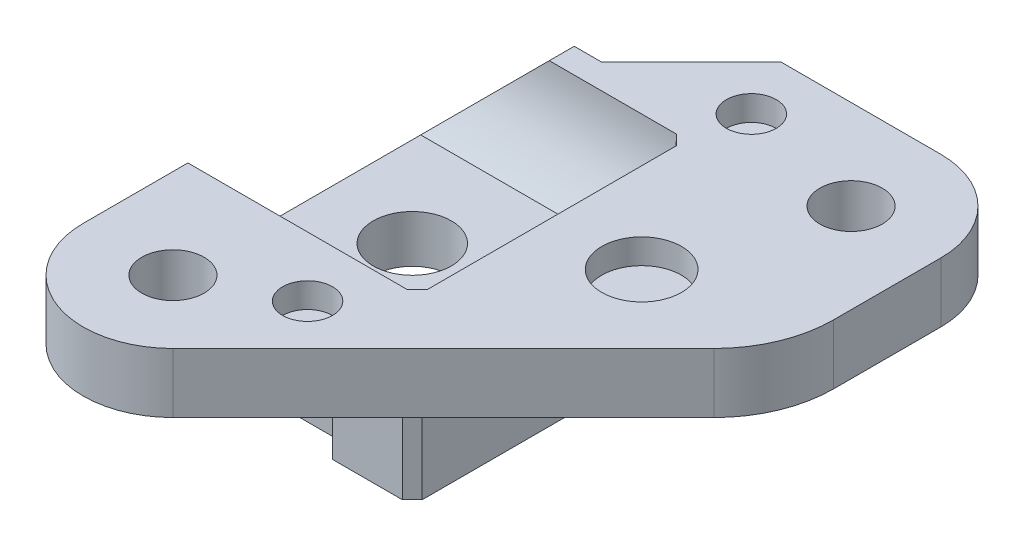
ISO-10303-21;
HEADER;
FILE_DESCRIPTION(('STEP AP214'),'2;1');
FILE_NAME('part.step','',(''),(''),'','','');
FILE_SCHEMA(('AUTOMOTIVE_DESIGN { 1 0 10303 214 1 1 1 1 }'));
ENDSEC;
DATA;
#1=APPLICATION_CONTEXT('core data for automotive mechanical design processes');
#2=APPLICATION_PROTOCOL_DEFINITION('international standard','automotive_design',2000,#1);
#3=PRODUCT_CONTEXT('',#1,'mechanical');
#4=PRODUCT('Part','Part','',(#3));
#5=PRODUCT_RELATED_PRODUCT_CATEGORY('part','',(#4));
#6=PRODUCT_DEFINITION_FORMATION('','',#4);
#7=PRODUCT_DEFINITION_CONTEXT('part definition',#1,'design');
#8=PRODUCT_DEFINITION('design','',#6,#7);
#9=PRODUCT_DEFINITION_SHAPE('','',#8);
#10=(LENGTH_UNIT() NAMED_UNIT(*) SI_UNIT(.MILLI.,.METRE.));
#11=(NAMED_UNIT(*) PLANE_ANGLE_UNIT() SI_UNIT($,.RADIAN.));
#12=(NAMED_UNIT(*) SI_UNIT($,.STERADIAN.) SOLID_ANGLE_UNIT());
#13=UNCERTAINTY_MEASURE_WITH_UNIT(LENGTH_MEASURE(1.E-05),#10,'distance_accuracy_value','');
#14=(GEOMETRIC_REPRESENTATION_CONTEXT(3) GLOBAL_UNCERTAINTY_ASSIGNED_CONTEXT((#13)) GLOBAL_UNIT_ASSIGNED_CONTEXT((#10,
#11,#12)) REPRESENTATION_CONTEXT('',''));
#15=CARTESIAN_POINT('',(0.,0.,0.));
#16=DIRECTION('',(0.,0.,1.));
#17=DIRECTION('',(1.,0.,0.));
#18=AXIS2_PLACEMENT_3D('',#15,#16,#17);
#19=CARTESIAN_POINT('',(14.,3.,-8.));
#20=DIRECTION('',(0.,1.,0.));
#21=DIRECTION('',(0.,0.,1.));
#22=AXIS2_PLACEMENT_3D('',#19,#20,#21);
#23=PLANE('',#22);
#24=CARTESIAN_POINT('',(7.5,3.,-9.5));
#25=DIRECTION('',(0.,1.,0.));
#26=DIRECTION('',(0.,0.,1.));
#27=AXIS2_PLACEMENT_3D('',#24,#25,#26);
#28=CIRCLE('',#27,1.25);
#29=CARTESIAN_POINT('',(7.5,3.,-8.25));
#30=VERTEX_POINT('',#29);
#31=EDGE_CURVE('E515',#30,#30,#28,.T.);
#32=ORIENTED_EDGE('',*,*,#31,.F.);
#33=EDGE_LOOP('',(#32));
#34=FACE_BOUND('',#33,.T.);
#35=CARTESIAN_POINT('',(4.5,3.,9.75));
#36=DIRECTION('',(0.,1.,0.));
#37=DIRECTION('',(0.,0.,1.));
#38=AXIS2_PLACEMENT_3D('',#35,#36,#37);
#39=CIRCLE('',#38,1.25);
#40=CARTESIAN_POINT('',(4.5,3.,11.));
#41=VERTEX_POINT('',#40);
#42=EDGE_CURVE('E509',#41,#41,#39,.T.);
#43=ORIENTED_EDGE('',*,*,#42,.F.);
#44=EDGE_LOOP('',(#43));
#45=FACE_BOUND('',#44,.T.);
#46=CARTESIAN_POINT('',(11.5,3.,0.));
#47=DIRECTION('',(0.,1.,0.));
#48=DIRECTION('',(0.,0.,1.));
#49=AXIS2_PLACEMENT_3D('',#46,#47,#48);
#50=CIRCLE('',#49,2.);
#51=CARTESIAN_POINT('',(11.5,3.,2.));
#52=VERTEX_POINT('',#51);
#53=EDGE_CURVE('E503',#52,#52,#50,.T.);
#54=ORIENTED_EDGE('',*,*,#53,.F.);
#55=EDGE_LOOP('',(#54));
#56=FACE_BOUND('',#55,.T.);
#57=DIRECTION('',(0.707106781186551,0.,-0.707106781186544));
#58=VECTOR('',#57,1.);
#59=CARTESIAN_POINT('',(3.18198051533945,3.,15.1819805153395));
#60=LINE('',#59,#58);
#61=CARTESIAN_POINT('',(3.18198051533945,3.,15.1819805153395));
#62=VERTEX_POINT('',#61);
#63=CARTESIAN_POINT('',(16.7426406871193,3.,1.62132034355981));
#64=VERTEX_POINT('',#63);
#65=EDGE_CURVE('E261',#62,#64,#60,.T.);
#66=ORIENTED_EDGE('',*,*,#65,.T.);
#67=CARTESIAN_POINT('',(12.5,3.,-2.6213203435595));
#68=DIRECTION('',(0.,1.,0.));
#69=DIRECTION('',(0.,0.,1.));
#70=AXIS2_PLACEMENT_3D('',#67,#68,#69);
#71=CIRCLE('',#70,6.);
#72=CARTESIAN_POINT('',(18.5,3.,-2.62132034355949));
#73=VERTEX_POINT('',#72);
#74=EDGE_CURVE('E11',#64,#73,#71,.T.);
#75=ORIENTED_EDGE('',*,*,#74,.T.);
#76=DIRECTION('',(0.,0.,-1.));
#77=VECTOR('',#76,1.);
#78=CARTESIAN_POINT('',(18.5,3.,-0.136038969320913));
#79=LINE('',#78,#77);
#80=CARTESIAN_POINT('',(18.5,3.,-8.));
#81=VERTEX_POINT('',#80);
#82=EDGE_CURVE('E263',#73,#81,#79,.T.);
#83=ORIENTED_EDGE('',*,*,#82,.T.);
#84=CARTESIAN_POINT('',(14.,3.,-8.));
#85=DIRECTION('',(0.,1.,0.));
#86=DIRECTION('',(0.,0.,1.));
#87=AXIS2_PLACEMENT_3D('',#84,#85,#86);
#88=CIRCLE('',#87,4.5);
#89=CARTESIAN_POINT('',(14.,3.,-12.5));
#90=VERTEX_POINT('',#89);
#91=EDGE_CURVE('E265',#81,#90,#88,.T.);
#92=ORIENTED_EDGE('',*,*,#91,.T.);
#93=DIRECTION('',(-1.,0.,0.));
#94=VECTOR('',#93,1.);
#95=CARTESIAN_POINT('',(5.99999999999999,3.,-12.5));
#96=LINE('',#95,#94);
#97=CARTESIAN_POINT('',(5.99999999999999,3.,-12.5));
#98=VERTEX_POINT('',#97);
#99=EDGE_CURVE('E267',#90,#98,#96,.T.);
#100=ORIENTED_EDGE('',*,*,#99,.T.);
#101=DIRECTION('',(-0.707106781186546,0.,0.707106781186549));
#102=VECTOR('',#101,1.);
#103=CARTESIAN_POINT('',(-4.5,3.,-1.99999999999998));
#104=LINE('',#103,#102);
#105=CARTESIAN_POINT('',(1.5,3.,-8.));
#106=VERTEX_POINT('',#105);
#107=EDGE_CURVE('E218',#98,#106,#104,.T.);
#108=ORIENTED_EDGE('',*,*,#107,.T.);
#109=DIRECTION('',(1.,0.,0.));
#110=VECTOR('',#109,1.);
#111=CARTESIAN_POINT('',(5.,3.,-8.));
#112=LINE('',#111,#110);
#113=CARTESIAN_POINT('',(0.120000000000051,3.,-8.));
#114=VERTEX_POINT('',#113);
#115=EDGE_CURVE('E209',#114,#106,#112,.T.);
#116=ORIENTED_EDGE('',*,*,#115,.F.);
#117=DIRECTION('',(0.,0.,-1.));
#118=VECTOR('',#117,1.);
#119=CARTESIAN_POINT('',(0.12000000000005,3.,-3.2375));
#120=LINE('',#119,#118);
#121=CARTESIAN_POINT('',(0.120000000000051,3.,-6.75));
#122=VERTEX_POINT('',#121);
#123=EDGE_CURVE('E193',#122,#114,#120,.T.);
#124=ORIENTED_EDGE('',*,*,#123,.F.);
#125=DIRECTION('',(-1.,0.,0.));
#126=VECTOR('',#125,1.);
#127=CARTESIAN_POINT('',(7.,3.,-6.75));
#128=LINE('',#127,#126);
#129=CARTESIAN_POINT('',(6.5,3.,-6.75));
#130=VERTEX_POINT('',#129);
#131=EDGE_CURVE('E318',#130,#122,#128,.T.);
#132=ORIENTED_EDGE('',*,*,#131,.F.);
#133=DIRECTION('',(-0.707106781186544,0.,-0.707106781186551));
#134=VECTOR('',#133,1.);
#135=CARTESIAN_POINT('',(13.2499999999999,3.,0.));
#136=LINE('',#135,#134);
#137=CARTESIAN_POINT('',(7.,3.,-6.24999999999999));
#138=VERTEX_POINT('',#137);
#139=EDGE_CURVE('E347',#130,#138,#136,.F.);
#140=ORIENTED_EDGE('',*,*,#139,.T.);
#141=DIRECTION('',(0.,0.,-1.));
#142=VECTOR('',#141,1.);
#143=CARTESIAN_POINT('',(7.,3.,-6.75));
#144=LINE('',#143,#142);
#145=CARTESIAN_POINT('',(7.,3.,6.24999999999999));
#146=VERTEX_POINT('',#145);
#147=EDGE_CURVE('E489',#146,#138,#144,.T.);
#148=ORIENTED_EDGE('',*,*,#147,.F.);
#149=DIRECTION('',(0.707106781186544,0.,-0.707106781186551));
#150=VECTOR('',#149,1.);
#151=CARTESIAN_POINT('',(13.2499999999999,3.,0.));
#152=LINE('',#151,#150);
#153=CARTESIAN_POINT('',(6.5,3.,6.75));
#154=VERTEX_POINT('',#153);
#155=EDGE_CURVE('E349',#146,#154,#152,.F.);
#156=ORIENTED_EDGE('',*,*,#155,.T.);
#157=DIRECTION('',(-1.,0.,0.));
#158=VECTOR('',#157,1.);
#159=CARTESIAN_POINT('',(7.,3.,6.75));
#160=LINE('',#159,#158);
#161=CARTESIAN_POINT('',(-4.5,3.,6.75));
#162=VERTEX_POINT('',#161);
#163=EDGE_CURVE('E492',#154,#162,#160,.T.);
#164=ORIENTED_EDGE('',*,*,#163,.T.);
#165=DIRECTION('',(0.,0.,1.));
#166=VECTOR('',#165,1.);
#167=CARTESIAN_POINT('',(-4.5,3.,6.5));
#168=LINE('',#167,#166);
#169=CARTESIAN_POINT('',(-4.5,3.,12.));
#170=VERTEX_POINT('',#169);
#171=EDGE_CURVE('E256',#162,#170,#168,.T.);
#172=ORIENTED_EDGE('',*,*,#171,.T.);
#173=CARTESIAN_POINT('',(0.,3.,12.));
#174=DIRECTION('',(0.,1.,0.));
#175=DIRECTION('',(0.,0.,-1.));
#176=AXIS2_PLACEMENT_3D('',#173,#174,#175);
#177=CIRCLE('',#176,4.5);
#178=EDGE_CURVE('E259',#170,#62,#177,.T.);
#179=ORIENTED_EDGE('',*,*,#178,.T.);
#180=EDGE_LOOP('',(#66,#75,#83,#92,#100,#108,#116,#124,#132,#140,#148,#156,#164,#172,#179));
#181=FACE_BOUND('',#180,.T.);
#182=CARTESIAN_POINT('',(0.,3.,12.));
#183=DIRECTION('',(0.,1.,0.));
#184=DIRECTION('',(0.,0.,1.));
#185=AXIS2_PLACEMENT_3D('',#182,#183,#184);
#186=CIRCLE('',#185,1.5625);
#187=CARTESIAN_POINT('',(0.,3.,13.5625));
#188=VERTEX_POINT('',#187);
#189=EDGE_CURVE('E249',#188,#188,#186,.T.);
#190=ORIENTED_EDGE('',*,*,#189,.F.);
#191=EDGE_LOOP('',(#190));
#192=FACE_BOUND('',#191,.T.);
#193=CARTESIAN_POINT('',(14.,3.,-8.));
#194=DIRECTION('',(0.,1.,0.));
#195=DIRECTION('',(0.,0.,1.));
#196=AXIS2_PLACEMENT_3D('',#193,#194,#195);
#197=CIRCLE('',#196,1.5625);
#198=CARTESIAN_POINT('',(14.,3.,-6.4375));
#199=VERTEX_POINT('',#198);
#200=EDGE_CURVE('E243',#199,#199,#197,.T.);
#201=ORIENTED_EDGE('',*,*,#200,.F.);
#202=EDGE_LOOP('',(#201));
#203=FACE_BOUND('',#202,.T.);
#204=ADVANCED_FACE('F30',(#34,#45,#56,#181,#192,#203),#23,.T.);
#205=CARTESIAN_POINT('',(14.,0.,-8.));
#206=DIRECTION('',(0.,1.,0.));
#207=DIRECTION('',(0.,0.,1.));
#208=AXIS2_PLACEMENT_3D('',#205,#206,#207);
#209=PLANE('',#208);
#210=CARTESIAN_POINT('',(0.,0.,12.));
#211=DIRECTION('',(0.,1.,0.));
#212=DIRECTION('',(0.,0.,1.));
#213=AXIS2_PLACEMENT_3D('',#210,#211,#212);
#214=CIRCLE('',#213,1.5625);
#215=CARTESIAN_POINT('',(0.,0.,13.5625));
#216=VERTEX_POINT('',#215);
#217=EDGE_CURVE('E246',#216,#216,#214,.T.);
#218=ORIENTED_EDGE('',*,*,#217,.T.);
#219=EDGE_LOOP('',(#218));
#220=FACE_BOUND('',#219,.T.);
#221=DIRECTION('',(0.,0.,-1.));
#222=VECTOR('',#221,1.);
#223=CARTESIAN_POINT('',(18.5,0.,-0.136038969320913));
#224=LINE('',#223,#222);
#225=CARTESIAN_POINT('',(18.5,0.,-2.62132034355949));
#226=VERTEX_POINT('',#225);
#227=CARTESIAN_POINT('',(18.5,0.,-8.));
#228=VERTEX_POINT('',#227);
#229=EDGE_CURVE('E275',#226,#228,#224,.T.);
#230=ORIENTED_EDGE('',*,*,#229,.F.);
#231=CARTESIAN_POINT('',(12.5,0.,-2.6213203435595));
#232=DIRECTION('',(0.,1.,0.));
#233=DIRECTION('',(0.,0.,1.));
#234=AXIS2_PLACEMENT_3D('',#231,#232,#233);
#235=CIRCLE('',#234,6.);
#236=CARTESIAN_POINT('',(16.7426406871193,0.,1.62132034355981));
#237=VERTEX_POINT('',#236);
#238=EDGE_CURVE('E52',#226,#237,#235,.F.);
#239=ORIENTED_EDGE('',*,*,#238,.T.);
#240=DIRECTION('',(0.707106781186551,0.,-0.707106781186544));
#241=VECTOR('',#240,1.);
#242=CARTESIAN_POINT('',(3.18198051533945,0.,15.1819805153395));
#243=LINE('',#242,#241);
#244=CARTESIAN_POINT('',(3.18198051533945,0.,15.1819805153395));
#245=VERTEX_POINT('',#244);
#246=EDGE_CURVE('E273',#245,#237,#243,.T.);
#247=ORIENTED_EDGE('',*,*,#246,.F.);
#248=CARTESIAN_POINT('',(0.,0.,12.));
#249=DIRECTION('',(0.,1.,0.));
#250=DIRECTION('',(0.,0.,-1.));
#251=AXIS2_PLACEMENT_3D('',#248,#249,#250);
#252=CIRCLE('',#251,4.5);
#253=CARTESIAN_POINT('',(-4.5,0.,12.));
#254=VERTEX_POINT('',#253);
#255=EDGE_CURVE('E271',#254,#245,#252,.T.);
#256=ORIENTED_EDGE('',*,*,#255,.F.);
#257=DIRECTION('',(0.,0.,1.));
#258=VECTOR('',#257,1.);
#259=CARTESIAN_POINT('',(-4.5,0.,12.));
#260=LINE('',#259,#258);
#261=CARTESIAN_POINT('',(-4.5,0.,8.));
#262=VERTEX_POINT('',#261);
#263=EDGE_CURVE('E252',#262,#254,#260,.T.);
#264=ORIENTED_EDGE('',*,*,#263,.F.);
#265=DIRECTION('',(1.,0.,0.));
#266=VECTOR('',#265,1.);
#267=CARTESIAN_POINT('',(14.,0.,8.));
#268=LINE('',#267,#266);
#269=CARTESIAN_POINT('',(5.,0.,8.));
#270=VERTEX_POINT('',#269);
#271=EDGE_CURVE('E239',#262,#270,#268,.T.);
#272=ORIENTED_EDGE('',*,*,#271,.T.);
#273=DIRECTION('',(0.,0.,1.));
#274=VECTOR('',#273,1.);
#275=CARTESIAN_POINT('',(5.,0.,-8.));
#276=LINE('',#275,#274);
#277=CARTESIAN_POINT('',(5.,0.,9.));
#278=VERTEX_POINT('',#277);
#279=EDGE_CURVE('E302',#270,#278,#276,.T.);
#280=ORIENTED_EDGE('',*,*,#279,.T.);
#281=DIRECTION('',(1.,0.,0.));
#282=VECTOR('',#281,1.);
#283=CARTESIAN_POINT('',(14.,0.,9.));
#284=LINE('',#283,#282);
#285=CARTESIAN_POINT('',(8.49999999999999,0.,9.));
#286=VERTEX_POINT('',#285);
#287=EDGE_CURVE('E299',#278,#286,#284,.T.);
#288=ORIENTED_EDGE('',*,*,#287,.T.);
#289=DIRECTION('',(-0.70710678118655,0.,0.707106781186545));
#290=VECTOR('',#289,1.);
#291=CARTESIAN_POINT('',(19.75,0.,-2.24999999999994));
#292=LINE('',#291,#290);
#293=CARTESIAN_POINT('',(9.,0.,8.5));
#294=VERTEX_POINT('',#293);
#295=EDGE_CURVE('E345',#286,#294,#292,.F.);
#296=ORIENTED_EDGE('',*,*,#295,.T.);
#297=DIRECTION('',(0.,0.,-1.));
#298=VECTOR('',#297,1.);
#299=CARTESIAN_POINT('',(9.,0.,-8.));
#300=LINE('',#299,#298);
#301=CARTESIAN_POINT('',(9.,0.,-8.5));
#302=VERTEX_POINT('',#301);
#303=EDGE_CURVE('E305',#294,#302,#300,.T.);
#304=ORIENTED_EDGE('',*,*,#303,.T.);
#305=DIRECTION('',(0.707106781186545,0.,0.70710678118655));
#306=VECTOR('',#305,1.);
#307=CARTESIAN_POINT('',(11.75,0.,-5.75));
#308=LINE('',#307,#306);
#309=CARTESIAN_POINT('',(8.5,0.,-9.));
#310=VERTEX_POINT('',#309);
#311=EDGE_CURVE('E351',#302,#310,#308,.F.);
#312=ORIENTED_EDGE('',*,*,#311,.T.);
#313=DIRECTION('',(-1.,0.,0.));
#314=VECTOR('',#313,1.);
#315=CARTESIAN_POINT('',(14.,0.,-9.));
#316=LINE('',#315,#314);
#317=CARTESIAN_POINT('',(5.,0.,-9.));
#318=VERTEX_POINT('',#317);
#319=EDGE_CURVE('E308',#310,#318,#316,.T.);
#320=ORIENTED_EDGE('',*,*,#319,.T.);
#321=DIRECTION('',(0.,0.,1.));
#322=VECTOR('',#321,1.);
#323=CARTESIAN_POINT('',(5.,0.,-8.));
#324=LINE('',#323,#322);
#325=CARTESIAN_POINT('',(5.,0.,-8.));
#326=VERTEX_POINT('',#325);
#327=EDGE_CURVE('E310',#318,#326,#324,.T.);
#328=ORIENTED_EDGE('',*,*,#327,.T.);
#329=DIRECTION('',(-1.,0.,0.));
#330=VECTOR('',#329,1.);
#331=CARTESIAN_POINT('',(14.,0.,-8.));
#332=LINE('',#331,#330);
#333=CARTESIAN_POINT('',(1.5,0.,-8.));
#334=VERTEX_POINT('',#333);
#335=EDGE_CURVE('E236',#326,#334,#332,.T.);
#336=ORIENTED_EDGE('',*,*,#335,.T.);
#337=DIRECTION('',(-0.707106781186546,0.,0.707106781186549));
#338=VECTOR('',#337,1.);
#339=CARTESIAN_POINT('',(1.,0.,-7.5));
#340=LINE('',#339,#338);
#341=CARTESIAN_POINT('',(5.99999999999999,0.,-12.5));
#342=VERTEX_POINT('',#341);
#343=EDGE_CURVE('E257',#342,#334,#340,.T.);
#344=ORIENTED_EDGE('',*,*,#343,.F.);
#345=DIRECTION('',(-1.,0.,0.));
#346=VECTOR('',#345,1.);
#347=CARTESIAN_POINT('',(5.99999999999999,0.,-12.5));
#348=LINE('',#347,#346);
#349=CARTESIAN_POINT('',(14.,0.,-12.5));
#350=VERTEX_POINT('',#349);
#351=EDGE_CURVE('E279',#350,#342,#348,.T.);
#352=ORIENTED_EDGE('',*,*,#351,.F.);
#353=CARTESIAN_POINT('',(14.,0.,-8.));
#354=DIRECTION('',(0.,1.,0.));
#355=DIRECTION('',(0.,0.,1.));
#356=AXIS2_PLACEMENT_3D('',#353,#354,#355);
#357=CIRCLE('',#356,4.5);
#358=EDGE_CURVE('E277',#228,#350,#357,.T.);
#359=ORIENTED_EDGE('',*,*,#358,.F.);
#360=EDGE_LOOP('',(#230,#239,#247,#256,#264,#272,#280,#288,#296,#304,#312,#320,#328,#336,#344,
#352,#359));
#361=FACE_BOUND('',#360,.T.);
#362=CARTESIAN_POINT('',(14.,0.,-8.));
#363=DIRECTION('',(0.,1.,0.));
#364=DIRECTION('',(0.,0.,1.));
#365=AXIS2_PLACEMENT_3D('',#362,#363,#364);
#366=CIRCLE('',#365,1.5625);
#367=CARTESIAN_POINT('',(14.,0.,-6.4375));
#368=VERTEX_POINT('',#367);
#369=EDGE_CURVE('E242',#368,#368,#366,.T.);
#370=ORIENTED_EDGE('',*,*,#369,.T.);
#371=EDGE_LOOP('',(#370));
#372=FACE_BOUND('',#371,.T.);
#373=ADVANCED_FACE('F390',(#220,#361,#372),#209,.F.);
#374=CARTESIAN_POINT('',(-4.5,3.,12.));
#375=DIRECTION('',(1.,0.,0.));
#376=DIRECTION('',(0.,0.,-1.));
#377=AXIS2_PLACEMENT_3D('',#374,#375,#376);
#378=PLANE('',#377);
#379=DIRECTION('',(0.,0.,1.));
#380=VECTOR('',#379,1.);
#381=CARTESIAN_POINT('',(-4.5,-1.62,-4.92118888074823));
#382=LINE('',#381,#380);
#383=CARTESIAN_POINT('',(-4.5,-1.62,-4.92118888074823));
#384=VERTEX_POINT('',#383);
#385=CARTESIAN_POINT('',(-4.5,-1.62,4.92118888074823));
#386=VERTEX_POINT('',#385);
#387=EDGE_CURVE('E498',#384,#386,#382,.T.);
#388=ORIENTED_EDGE('',*,*,#387,.F.);
#389=DIRECTION('',(0.,0.,-1.));
#390=VECTOR('',#389,1.);
#391=CARTESIAN_POINT('',(-4.5,-1.62,-3.2375));
#392=LINE('',#391,#390);
#393=CARTESIAN_POINT('',(-4.5,-1.62,-8.));
#394=VERTEX_POINT('',#393);
#395=EDGE_CURVE('E204',#384,#394,#392,.T.);
#396=ORIENTED_EDGE('',*,*,#395,.T.);
#397=DIRECTION('',(0.,-1.,0.));
#398=VECTOR('',#397,1.);
#399=CARTESIAN_POINT('',(-4.5,25.5,-8.));
#400=LINE('',#399,#398);
#401=CARTESIAN_POINT('',(-4.5,-4.,-8.));
#402=VERTEX_POINT('',#401);
#403=EDGE_CURVE('E212',#394,#402,#400,.T.);
#404=ORIENTED_EDGE('',*,*,#403,.T.);
#405=DIRECTION('',(0.,0.,-1.));
#406=VECTOR('',#405,1.);
#407=CARTESIAN_POINT('',(-4.5,-4.,-8.));
#408=LINE('',#407,#406);
#409=CARTESIAN_POINT('',(-4.5,-4.,8.));
#410=VERTEX_POINT('',#409);
#411=EDGE_CURVE('E470',#410,#402,#408,.T.);
#412=ORIENTED_EDGE('',*,*,#411,.F.);
#413=DIRECTION('',(0.,-1.,0.));
#414=VECTOR('',#413,1.);
#415=CARTESIAN_POINT('',(-4.5,25.5,8.));
#416=LINE('',#415,#414);
#417=EDGE_CURVE('E229',#262,#410,#416,.T.);
#418=ORIENTED_EDGE('',*,*,#417,.F.);
#419=ORIENTED_EDGE('',*,*,#263,.T.);
#420=DIRECTION('',(0.,-1.,0.));
#421=VECTOR('',#420,1.);
#422=CARTESIAN_POINT('',(-4.5,3.,12.));
#423=LINE('',#422,#421);
#424=EDGE_CURVE('E294',#170,#254,#423,.T.);
#425=ORIENTED_EDGE('',*,*,#424,.F.);
#426=ORIENTED_EDGE('',*,*,#171,.F.);
#427=CARTESIAN_POINT('',(-4.5,3.,0.));
#428=DIRECTION('',(-1.,0.,0.));
#429=DIRECTION('',(0.,0.,1.));
#430=AXIS2_PLACEMENT_3D('',#427,#428,#429);
#431=CIRCLE('',#430,6.75);
#432=EDGE_CURVE('E495',#386,#162,#431,.T.);
#433=ORIENTED_EDGE('',*,*,#432,.F.);
#434=EDGE_LOOP('',(#388,#396,#404,#412,#418,#419,#425,#426,#433));
#435=FACE_BOUND('',#434,.T.);
#436=ADVANCED_FACE('F396',(#435),#378,.F.);
#437=CARTESIAN_POINT('',(0.,3.,12.));
#438=DIRECTION('',(0.,-1.,0.));
#439=DIRECTION('',(0.,0.,-1.));
#440=AXIS2_PLACEMENT_3D('',#437,#438,#439);
#441=CYLINDRICAL_SURFACE('',#440,4.5);
#442=ORIENTED_EDGE('',*,*,#255,.T.);
#443=DIRECTION('',(0.,-1.,0.));
#444=VECTOR('',#443,1.);
#445=CARTESIAN_POINT('',(3.18198051533945,3.,15.1819805153395));
#446=LINE('',#445,#444);
#447=EDGE_CURVE('E291',#62,#245,#446,.T.);
#448=ORIENTED_EDGE('',*,*,#447,.F.);
#449=ORIENTED_EDGE('',*,*,#178,.F.);
#450=ORIENTED_EDGE('',*,*,#424,.T.);
#451=EDGE_LOOP('',(#442,#448,#449,#450));
#452=FACE_BOUND('',#451,.T.);
#453=ADVANCED_FACE('F424',(#452),#441,.T.);
#454=CARTESIAN_POINT('',(3.18198051533945,3.,15.1819805153395));
#455=DIRECTION('',(-0.707106781186544,0.,-0.707106781186551));
#456=DIRECTION('',(-0.707106781186551,0.,0.707106781186544));
#457=AXIS2_PLACEMENT_3D('',#454,#455,#456);
#458=PLANE('',#457);
#459=ORIENTED_EDGE('',*,*,#246,.T.);
#460=DIRECTION('',(0.,-1.,0.));
#461=VECTOR('',#460,1.);
#462=CARTESIAN_POINT('',(16.7426406871193,3.,1.62132034355981));
#463=LINE('',#462,#461);
#464=EDGE_CURVE('E38',#237,#64,#463,.F.);
#465=ORIENTED_EDGE('',*,*,#464,.T.);
#466=ORIENTED_EDGE('',*,*,#65,.F.);
#467=ORIENTED_EDGE('',*,*,#447,.T.);
#468=EDGE_LOOP('',(#459,#465,#466,#467));
#469=FACE_BOUND('',#468,.T.);
#470=ADVANCED_FACE('F420',(#469),#458,.F.);
#471=CARTESIAN_POINT('',(18.5,3.,-0.136038969320913));
#472=DIRECTION('',(-1.,0.,0.));
#473=DIRECTION('',(0.,0.,1.));
#474=AXIS2_PLACEMENT_3D('',#471,#472,#473);
#475=PLANE('',#474);
#476=ORIENTED_EDGE('',*,*,#82,.F.);
#477=DIRECTION('',(0.,-1.,0.));
#478=VECTOR('',#477,1.);
#479=CARTESIAN_POINT('',(18.5,3.,-2.6213203435595));
#480=LINE('',#479,#478);
#481=EDGE_CURVE('E823',#73,#226,#480,.T.);
#482=ORIENTED_EDGE('',*,*,#481,.T.);
#483=ORIENTED_EDGE('',*,*,#229,.T.);
#484=DIRECTION('',(0.,-1.,0.));
#485=VECTOR('',#484,1.);
#486=CARTESIAN_POINT('',(18.5,3.,-8.));
#487=LINE('',#486,#485);
#488=EDGE_CURVE('E288',#81,#228,#487,.T.);
#489=ORIENTED_EDGE('',*,*,#488,.F.);
#490=EDGE_LOOP('',(#476,#482,#483,#489));
#491=FACE_BOUND('',#490,.T.);
#492=ADVANCED_FACE('F416',(#491),#475,.F.);
#493=CARTESIAN_POINT('',(14.,3.,-8.));
#494=DIRECTION('',(0.,-1.,0.));
#495=DIRECTION('',(0.,0.,-1.));
#496=AXIS2_PLACEMENT_3D('',#493,#494,#495);
#497=CYLINDRICAL_SURFACE('',#496,4.5);
#498=ORIENTED_EDGE('',*,*,#358,.T.);
#499=DIRECTION('',(0.,-1.,0.));
#500=VECTOR('',#499,1.);
#501=CARTESIAN_POINT('',(14.,3.,-12.5));
#502=LINE('',#501,#500);
#503=EDGE_CURVE('E285',#90,#350,#502,.T.);
#504=ORIENTED_EDGE('',*,*,#503,.F.);
#505=ORIENTED_EDGE('',*,*,#91,.F.);
#506=ORIENTED_EDGE('',*,*,#488,.T.);
#507=EDGE_LOOP('',(#498,#504,#505,#506));
#508=FACE_BOUND('',#507,.T.);
#509=ADVANCED_FACE('F412',(#508),#497,.T.);
#510=CARTESIAN_POINT('',(5.99999999999999,3.,-12.5));
#511=DIRECTION('',(0.,0.,1.));
#512=DIRECTION('',(1.,0.,0.));
#513=AXIS2_PLACEMENT_3D('',#510,#511,#512);
#514=PLANE('',#513);
#515=ORIENTED_EDGE('',*,*,#351,.T.);
#516=DIRECTION('',(0.,-1.,0.));
#517=VECTOR('',#516,1.);
#518=CARTESIAN_POINT('',(5.99999999999999,3.,-12.5));
#519=LINE('',#518,#517);
#520=EDGE_CURVE('E269',#98,#342,#519,.T.);
#521=ORIENTED_EDGE('',*,*,#520,.F.);
#522=ORIENTED_EDGE('',*,*,#99,.F.);
#523=ORIENTED_EDGE('',*,*,#503,.T.);
#524=EDGE_LOOP('',(#515,#521,#522,#523));
#525=FACE_BOUND('',#524,.T.);
#526=ADVANCED_FACE('F408',(#525),#514,.F.);
#527=CARTESIAN_POINT('',(1.,3.,-7.5));
#528=DIRECTION('',(0.707106781186548,0.,0.707106781186546));
#529=DIRECTION('',(0.707106781186546,0.,-0.707106781186549));
#530=AXIS2_PLACEMENT_3D('',#527,#528,#529);
#531=PLANE('',#530);
#532=ORIENTED_EDGE('',*,*,#343,.T.);
#533=DIRECTION('',(0.,1.,0.));
#534=VECTOR('',#533,1.);
#535=CARTESIAN_POINT('',(1.5,3.,-8.));
#536=LINE('',#535,#534);
#537=EDGE_CURVE('E297',#334,#106,#536,.T.);
#538=ORIENTED_EDGE('',*,*,#537,.T.);
#539=ORIENTED_EDGE('',*,*,#107,.F.);
#540=ORIENTED_EDGE('',*,*,#520,.T.);
#541=EDGE_LOOP('',(#532,#538,#539,#540));
#542=FACE_BOUND('',#541,.T.);
#543=ADVANCED_FACE('F405',(#542),#531,.F.);
#544=CARTESIAN_POINT('',(0.,3.,12.));
#545=DIRECTION('',(0.,-1.,0.));
#546=DIRECTION('',(0.,0.,-1.));
#547=AXIS2_PLACEMENT_3D('',#544,#545,#546);
#548=CYLINDRICAL_SURFACE('',#547,1.5625);
#549=ORIENTED_EDGE('',*,*,#189,.T.);
#550=EDGE_LOOP('',(#549));
#551=FACE_BOUND('',#550,.T.);
#552=ORIENTED_EDGE('',*,*,#217,.F.);
#553=EDGE_LOOP('',(#552));
#554=FACE_BOUND('',#553,.T.);
#555=ADVANCED_FACE('F402',(#551,#554),#548,.F.);
#556=CARTESIAN_POINT('',(14.,3.,-8.));
#557=DIRECTION('',(0.,-1.,0.));
#558=DIRECTION('',(0.,0.,-1.));
#559=AXIS2_PLACEMENT_3D('',#556,#557,#558);
#560=CYLINDRICAL_SURFACE('',#559,1.5625);
#561=ORIENTED_EDGE('',*,*,#200,.T.);
#562=EDGE_LOOP('',(#561));
#563=FACE_BOUND('',#562,.T.);
#564=ORIENTED_EDGE('',*,*,#369,.F.);
#565=EDGE_LOOP('',(#564));
#566=FACE_BOUND('',#565,.T.);
#567=ADVANCED_FACE('F582',(#563,#566),#560,.F.);
#568=CARTESIAN_POINT('',(9.,25.5,-9.));
#569=DIRECTION('',(1.,0.,0.));
#570=DIRECTION('',(0.,0.,-1.));
#571=AXIS2_PLACEMENT_3D('',#568,#569,#570);
#572=PLANE('',#571);
#573=ORIENTED_EDGE('',*,*,#303,.F.);
#574=DIRECTION('',(0.,-1.,0.));
#575=VECTOR('',#574,1.);
#576=CARTESIAN_POINT('',(9.,25.5,8.5));
#577=LINE('',#576,#575);
#578=CARTESIAN_POINT('',(9.,-4.,8.49999999999999));
#579=VERTEX_POINT('',#578);
#580=EDGE_CURVE('E320',#294,#579,#577,.T.);
#581=ORIENTED_EDGE('',*,*,#580,.T.);
#582=DIRECTION('',(0.,0.,1.));
#583=VECTOR('',#582,1.);
#584=CARTESIAN_POINT('',(9.,-4.,-9.));
#585=LINE('',#584,#583);
#586=CARTESIAN_POINT('',(9.,-4.,-8.5));
#587=VERTEX_POINT('',#586);
#588=EDGE_CURVE('E449',#587,#579,#585,.T.);
#589=ORIENTED_EDGE('',*,*,#588,.F.);
#590=DIRECTION('',(0.,1.,0.));
#591=VECTOR('',#590,1.);
#592=CARTESIAN_POINT('',(9.,25.5,-8.5));
#593=LINE('',#592,#591);
#594=EDGE_CURVE('E313',#587,#302,#593,.T.);
#595=ORIENTED_EDGE('',*,*,#594,.T.);
#596=EDGE_LOOP('',(#573,#581,#589,#595));
#597=FACE_BOUND('',#596,.T.);
#598=ADVANCED_FACE('F445',(#597),#572,.T.);
#599=CARTESIAN_POINT('',(9.,25.5,-9.));
#600=DIRECTION('',(0.,0.,-1.));
#601=DIRECTION('',(-1.,0.,0.));
#602=AXIS2_PLACEMENT_3D('',#599,#600,#601);
#603=PLANE('',#602);
#604=ORIENTED_EDGE('',*,*,#319,.F.);
#605=DIRECTION('',(0.,-1.,0.));
#606=VECTOR('',#605,1.);
#607=CARTESIAN_POINT('',(8.5,25.5,-9.));
#608=LINE('',#607,#606);
#609=CARTESIAN_POINT('',(8.5,-4.,-9.));
#610=VERTEX_POINT('',#609);
#611=EDGE_CURVE('E342',#310,#610,#608,.T.);
#612=ORIENTED_EDGE('',*,*,#611,.T.);
#613=DIRECTION('',(1.,0.,0.));
#614=VECTOR('',#613,1.);
#615=CARTESIAN_POINT('',(9.,-4.,-9.));
#616=LINE('',#615,#614);
#617=CARTESIAN_POINT('',(5.,-4.,-9.));
#618=VERTEX_POINT('',#617);
#619=EDGE_CURVE('E223',#618,#610,#616,.T.);
#620=ORIENTED_EDGE('',*,*,#619,.F.);
#621=DIRECTION('',(0.,-1.,0.));
#622=VECTOR('',#621,1.);
#623=CARTESIAN_POINT('',(5.,25.5,-9.));
#624=LINE('',#623,#622);
#625=EDGE_CURVE('E220',#318,#618,#624,.T.);
#626=ORIENTED_EDGE('',*,*,#625,.F.);
#627=EDGE_LOOP('',(#604,#612,#620,#626));
#628=FACE_BOUND('',#627,.T.);
#629=ADVANCED_FACE('F455',(#628),#603,.T.);
#630=CARTESIAN_POINT('',(5.,25.5,-9.));
#631=DIRECTION('',(-1.,0.,0.));
#632=DIRECTION('',(0.,0.,1.));
#633=AXIS2_PLACEMENT_3D('',#630,#631,#632);
#634=PLANE('',#633);
#635=ORIENTED_EDGE('',*,*,#327,.F.);
#636=ORIENTED_EDGE('',*,*,#625,.T.);
#637=DIRECTION('',(0.,0.,-1.));
#638=VECTOR('',#637,1.);
#639=CARTESIAN_POINT('',(5.,-4.,-9.));
#640=LINE('',#639,#638);
#641=CARTESIAN_POINT('',(5.,-4.,-8.));
#642=VERTEX_POINT('',#641);
#643=EDGE_CURVE('E463',#642,#618,#640,.T.);
#644=ORIENTED_EDGE('',*,*,#643,.F.);
#645=DIRECTION('',(0.,-1.,0.));
#646=VECTOR('',#645,1.);
#647=CARTESIAN_POINT('',(5.,25.5,-8.));
#648=LINE('',#647,#646);
#649=EDGE_CURVE('E219',#326,#642,#648,.T.);
#650=ORIENTED_EDGE('',*,*,#649,.F.);
#651=EDGE_LOOP('',(#635,#636,#644,#650));
#652=FACE_BOUND('',#651,.T.);
#653=ADVANCED_FACE('F461',(#652),#634,.T.);
#654=CARTESIAN_POINT('',(5.,25.5,8.));
#655=DIRECTION('',(-1.,0.,0.));
#656=DIRECTION('',(0.,0.,1.));
#657=AXIS2_PLACEMENT_3D('',#654,#655,#656);
#658=PLANE('',#657);
#659=ORIENTED_EDGE('',*,*,#279,.F.);
#660=DIRECTION('',(0.,-1.,0.));
#661=VECTOR('',#660,1.);
#662=CARTESIAN_POINT('',(5.,25.5,8.));
#663=LINE('',#662,#661);
#664=CARTESIAN_POINT('',(5.,-4.,8.));
#665=VERTEX_POINT('',#664);
#666=EDGE_CURVE('E231',#270,#665,#663,.T.);
#667=ORIENTED_EDGE('',*,*,#666,.T.);
#668=DIRECTION('',(0.,0.,-1.));
#669=VECTOR('',#668,1.);
#670=CARTESIAN_POINT('',(5.,-4.,8.));
#671=LINE('',#670,#669);
#672=CARTESIAN_POINT('',(5.,-4.,9.));
#673=VERTEX_POINT('',#672);
#674=EDGE_CURVE('E477',#673,#665,#671,.T.);
#675=ORIENTED_EDGE('',*,*,#674,.F.);
#676=DIRECTION('',(0.,-1.,0.));
#677=VECTOR('',#676,1.);
#678=CARTESIAN_POINT('',(5.,25.5,9.));
#679=LINE('',#678,#677);
#680=EDGE_CURVE('E233',#278,#673,#679,.T.);
#681=ORIENTED_EDGE('',*,*,#680,.F.);
#682=EDGE_LOOP('',(#659,#667,#675,#681));
#683=FACE_BOUND('',#682,.T.);
#684=ADVANCED_FACE('F565',(#683),#658,.T.);
#685=CARTESIAN_POINT('',(9.,25.5,9.));
#686=DIRECTION('',(0.,0.,1.));
#687=DIRECTION('',(1.,0.,0.));
#688=AXIS2_PLACEMENT_3D('',#685,#686,#687);
#689=PLANE('',#688);
#690=DIRECTION('',(-1.,0.,0.));
#691=VECTOR('',#690,1.);
#692=CARTESIAN_POINT('',(9.,-4.,9.));
#693=LINE('',#692,#691);
#694=CARTESIAN_POINT('',(8.49999999999999,-4.,9.));
#695=VERTEX_POINT('',#694);
#696=EDGE_CURVE('E480',#695,#673,#693,.T.);
#697=ORIENTED_EDGE('',*,*,#696,.F.);
#698=DIRECTION('',(0.,1.,0.));
#699=VECTOR('',#698,1.);
#700=CARTESIAN_POINT('',(8.49999999999999,25.5,9.));
#701=LINE('',#700,#699);
#702=EDGE_CURVE('E327',#695,#286,#701,.T.);
#703=ORIENTED_EDGE('',*,*,#702,.T.);
#704=ORIENTED_EDGE('',*,*,#287,.F.);
#705=ORIENTED_EDGE('',*,*,#680,.T.);
#706=EDGE_LOOP('',(#697,#703,#704,#705));
#707=FACE_BOUND('',#706,.T.);
#708=ADVANCED_FACE('F561',(#707),#689,.T.);
#709=CARTESIAN_POINT('',(0.,25.5,0.));
#710=DIRECTION('',(0.,-1.,0.));
#711=DIRECTION('',(0.,0.,-1.));
#712=AXIS2_PLACEMENT_3D('',#709,#710,#711);
#713=CYLINDRICAL_SURFACE('',#712,1.96);
#714=CARTESIAN_POINT('',(0.,-1.62,0.));
#715=DIRECTION('',(0.,-1.,0.));
#716=DIRECTION('',(0.,0.,-1.));
#717=AXIS2_PLACEMENT_3D('',#714,#715,#716);
#718=CIRCLE('',#717,1.96);
#719=CARTESIAN_POINT('',(0.,-1.62,-1.96));
#720=VERTEX_POINT('',#719);
#721=EDGE_CURVE('E314',#720,#720,#718,.F.);
#722=ORIENTED_EDGE('',*,*,#721,.T.);
#723=EDGE_LOOP('',(#722));
#724=FACE_BOUND('',#723,.T.);
#725=CARTESIAN_POINT('',(0.,-4.,0.));
#726=DIRECTION('',(0.,-1.,0.));
#727=DIRECTION('',(0.,0.,-1.));
#728=AXIS2_PLACEMENT_3D('',#725,#726,#727);
#729=CIRCLE('',#728,1.96);
#730=CARTESIAN_POINT('',(0.,-4.,-1.96));
#731=VERTEX_POINT('',#730);
#732=EDGE_CURVE('E317',#731,#731,#729,.T.);
#733=ORIENTED_EDGE('',*,*,#732,.T.);
#734=EDGE_LOOP('',(#733));
#735=FACE_BOUND('',#734,.T.);
#736=ADVANCED_FACE('F564',(#724,#735),#713,.F.);
#737=CARTESIAN_POINT('',(5.,25.5,8.));
#738=DIRECTION('',(0.,0.,1.));
#739=DIRECTION('',(1.,0.,0.));
#740=AXIS2_PLACEMENT_3D('',#737,#738,#739);
#741=PLANE('',#740);
#742=ORIENTED_EDGE('',*,*,#271,.F.);
#743=ORIENTED_EDGE('',*,*,#417,.T.);
#744=DIRECTION('',(-1.,0.,0.));
#745=VECTOR('',#744,1.);
#746=CARTESIAN_POINT('',(5.,-4.,8.));
#747=LINE('',#746,#745);
#748=EDGE_CURVE('E474',#665,#410,#747,.T.);
#749=ORIENTED_EDGE('',*,*,#748,.F.);
#750=ORIENTED_EDGE('',*,*,#666,.F.);
#751=EDGE_LOOP('',(#742,#743,#749,#750));
#752=FACE_BOUND('',#751,.T.);
#753=ADVANCED_FACE('F570',(#752),#741,.T.);
#754=CARTESIAN_POINT('',(5.,25.5,-8.));
#755=DIRECTION('',(0.,0.,-1.));
#756=DIRECTION('',(-1.,0.,0.));
#757=AXIS2_PLACEMENT_3D('',#754,#755,#756);
#758=PLANE('',#757);
#759=DIRECTION('',(-0.707106781186551,-0.707106781186544,0.));
#760=VECTOR('',#759,1.);
#761=CARTESIAN_POINT('',(-4.5,-1.62,-8.));
#762=LINE('',#761,#760);
#763=EDGE_CURVE('E196',#114,#394,#762,.T.);
#764=ORIENTED_EDGE('',*,*,#763,.F.);
#765=ORIENTED_EDGE('',*,*,#115,.T.);
#766=ORIENTED_EDGE('',*,*,#537,.F.);
#767=ORIENTED_EDGE('',*,*,#335,.F.);
#768=ORIENTED_EDGE('',*,*,#649,.T.);
#769=DIRECTION('',(1.,0.,0.));
#770=VECTOR('',#769,1.);
#771=CARTESIAN_POINT('',(5.,-4.,-8.));
#772=LINE('',#771,#770);
#773=EDGE_CURVE('E469',#402,#642,#772,.T.);
#774=ORIENTED_EDGE('',*,*,#773,.F.);
#775=ORIENTED_EDGE('',*,*,#403,.F.);
#776=EDGE_LOOP('',(#764,#765,#766,#767,#768,#774,#775));
#777=FACE_BOUND('',#776,.T.);
#778=ADVANCED_FACE('F208',(#777),#758,.T.);
#779=CARTESIAN_POINT('',(9.,-4.,9.));
#780=DIRECTION('',(0.,-1.,0.));
#781=DIRECTION('',(0.,0.,-1.));
#782=AXIS2_PLACEMENT_3D('',#779,#780,#781);
#783=PLANE('',#782);
#784=ORIENTED_EDGE('',*,*,#588,.T.);
#785=DIRECTION('',(0.70710678118655,0.,-0.707106781186545));
#786=VECTOR('',#785,1.);
#787=CARTESIAN_POINT('',(8.75,-4.,8.75));
#788=LINE('',#787,#786);
#789=EDGE_CURVE('E325',#579,#695,#788,.F.);
#790=ORIENTED_EDGE('',*,*,#789,.T.);
#791=ORIENTED_EDGE('',*,*,#696,.T.);
#792=ORIENTED_EDGE('',*,*,#674,.T.);
#793=ORIENTED_EDGE('',*,*,#748,.T.);
#794=ORIENTED_EDGE('',*,*,#411,.T.);
#795=ORIENTED_EDGE('',*,*,#773,.T.);
#796=ORIENTED_EDGE('',*,*,#643,.T.);
#797=ORIENTED_EDGE('',*,*,#619,.T.);
#798=DIRECTION('',(-0.707106781186545,0.,-0.70710678118655));
#799=VECTOR('',#798,1.);
#800=CARTESIAN_POINT('',(17.75,-4.,0.250000000000063));
#801=LINE('',#800,#799);
#802=EDGE_CURVE('E323',#610,#587,#801,.F.);
#803=ORIENTED_EDGE('',*,*,#802,.T.);
#804=EDGE_LOOP('',(#784,#790,#791,#792,#793,#794,#795,#796,#797,#803));
#805=FACE_BOUND('',#804,.T.);
#806=ORIENTED_EDGE('',*,*,#732,.F.);
#807=EDGE_LOOP('',(#806));
#808=FACE_BOUND('',#807,.T.);
#809=ADVANCED_FACE('F466',(#805,#808),#783,.T.);
#810=CARTESIAN_POINT('',(7.,-1.62,-4.92118888074823));
#811=DIRECTION('',(0.,-1.,0.));
#812=DIRECTION('',(0.,0.,-1.));
#813=AXIS2_PLACEMENT_3D('',#810,#811,#812);
#814=PLANE('',#813);
#815=DIRECTION('',(-1.,0.,0.));
#816=VECTOR('',#815,1.);
#817=CARTESIAN_POINT('',(7.,-1.62,4.92118888074823));
#818=LINE('',#817,#816);
#819=CARTESIAN_POINT('',(6.5,-1.62,4.92118888074823));
#820=VERTEX_POINT('',#819);
#821=EDGE_CURVE('E488',#820,#386,#818,.T.);
#822=ORIENTED_EDGE('',*,*,#821,.F.);
#823=DIRECTION('',(0.,0.,-1.));
#824=VECTOR('',#823,1.);
#825=CARTESIAN_POINT('',(6.5,-1.62,-4.92118888074823));
#826=LINE('',#825,#824);
#827=CARTESIAN_POINT('',(6.5,-1.62,-4.92118888074823));
#828=VERTEX_POINT('',#827);
#829=EDGE_CURVE('E338',#820,#828,#826,.T.);
#830=ORIENTED_EDGE('',*,*,#829,.T.);
#831=DIRECTION('',(-1.,0.,0.));
#832=VECTOR('',#831,1.);
#833=CARTESIAN_POINT('',(7.,-1.62,-4.92118888074823));
#834=LINE('',#833,#832);
#835=EDGE_CURVE('E485',#828,#384,#834,.T.);
#836=ORIENTED_EDGE('',*,*,#835,.T.);
#837=ORIENTED_EDGE('',*,*,#387,.T.);
#838=EDGE_LOOP('',(#822,#830,#836,#837));
#839=FACE_BOUND('',#838,.T.);
#840=ORIENTED_EDGE('',*,*,#721,.F.);
#841=EDGE_LOOP('',(#840));
#842=FACE_BOUND('',#841,.T.);
#843=ADVANCED_FACE('F552',(#839,#842),#814,.F.);
#844=CARTESIAN_POINT('',(7.,3.,0.));
#845=DIRECTION('',(-1.,0.,0.));
#846=DIRECTION('',(0.,0.,1.));
#847=AXIS2_PLACEMENT_3D('',#844,#845,#846);
#848=CYLINDRICAL_SURFACE('',#847,6.75);
#849=ORIENTED_EDGE('',*,*,#131,.T.);
#850=CARTESIAN_POINT('',(0.12000000000005,3.,0.));
#851=DIRECTION('',(0.707106781186544,-0.707106781186551,0.));
#852=DIRECTION('',(-0.707106781186551,-0.707106781186544,0.));
#853=AXIS2_PLACEMENT_3D('',#850,#851,#852);
#854=ELLIPSE('',#853,9.54594154601844,6.75);
#855=EDGE_CURVE('E199',#122,#384,#854,.F.);
#856=ORIENTED_EDGE('',*,*,#855,.T.);
#857=ORIENTED_EDGE('',*,*,#835,.F.);
#858=CARTESIAN_POINT('',(6.5,3.,0.));
#859=DIRECTION('',(-1.,0.,0.));
#860=DIRECTION('',(0.,0.,1.));
#861=AXIS2_PLACEMENT_3D('',#858,#859,#860);
#862=CIRCLE('',#861,6.75);
#863=EDGE_CURVE('E336',#828,#130,#862,.F.);
#864=ORIENTED_EDGE('',*,*,#863,.T.);
#865=EDGE_LOOP('',(#849,#856,#857,#864));
#866=FACE_BOUND('',#865,.T.);
#867=ADVANCED_FACE('F550',(#866),#848,.F.);
#868=CARTESIAN_POINT('',(7.,3.,0.));
#869=DIRECTION('',(-1.,0.,0.));
#870=DIRECTION('',(0.,0.,1.));
#871=AXIS2_PLACEMENT_3D('',#868,#869,#870);
#872=CYLINDRICAL_SURFACE('',#871,6.75);
#873=ORIENTED_EDGE('',*,*,#163,.F.);
#874=CARTESIAN_POINT('',(6.5,3.,0.));
#875=DIRECTION('',(-1.,0.,0.));
#876=DIRECTION('',(0.,0.,1.));
#877=AXIS2_PLACEMENT_3D('',#874,#875,#876);
#878=CIRCLE('',#877,6.75);
#879=EDGE_CURVE('E340',#154,#820,#878,.F.);
#880=ORIENTED_EDGE('',*,*,#879,.T.);
#881=ORIENTED_EDGE('',*,*,#821,.T.);
#882=ORIENTED_EDGE('',*,*,#432,.T.);
#883=EDGE_LOOP('',(#873,#880,#881,#882));
#884=FACE_BOUND('',#883,.T.);
#885=ADVANCED_FACE('F436',(#884),#872,.F.);
#886=CARTESIAN_POINT('',(7.,3.,0.));
#887=DIRECTION('',(-1.,0.,0.));
#888=DIRECTION('',(0.,0.,1.));
#889=AXIS2_PLACEMENT_3D('',#886,#887,#888);
#890=PLANE('',#889);
#891=ORIENTED_EDGE('',*,*,#147,.T.);
#892=CARTESIAN_POINT('',(7.,3.,0.));
#893=DIRECTION('',(-1.,0.,0.));
#894=DIRECTION('',(0.,0.,1.));
#895=AXIS2_PLACEMENT_3D('',#892,#893,#894);
#896=CIRCLE('',#895,6.24999999999999);
#897=CARTESIAN_POINT('',(7.,-1.11999999999999,-4.69979786799392));
#898=VERTEX_POINT('',#897);
#899=EDGE_CURVE('E333',#138,#898,#896,.T.);
#900=ORIENTED_EDGE('',*,*,#899,.T.);
#901=DIRECTION('',(0.,0.,1.));
#902=VECTOR('',#901,1.);
#903=CARTESIAN_POINT('',(7.,-1.11999999999999,0.));
#904=LINE('',#903,#902);
#905=CARTESIAN_POINT('',(7.,-1.11999999999996,4.69979786799392));
#906=VERTEX_POINT('',#905);
#907=EDGE_CURVE('E331',#898,#906,#904,.T.);
#908=ORIENTED_EDGE('',*,*,#907,.T.);
#909=CARTESIAN_POINT('',(7.,3.,0.));
#910=DIRECTION('',(-1.,0.,0.));
#911=DIRECTION('',(0.,0.,1.));
#912=AXIS2_PLACEMENT_3D('',#909,#910,#911);
#913=CIRCLE('',#912,6.24999999999999);
#914=EDGE_CURVE('E329',#906,#146,#913,.T.);
#915=ORIENTED_EDGE('',*,*,#914,.T.);
#916=EDGE_LOOP('',(#891,#900,#908,#915));
#917=FACE_BOUND('',#916,.T.);
#918=ADVANCED_FACE('F431',(#917),#890,.T.);
#919=CARTESIAN_POINT('',(9.,25.5,8.5));
#920=DIRECTION('',(-0.707106781186545,0.,-0.70710678118655));
#921=DIRECTION('',(-0.70710678118655,0.,0.707106781186545));
#922=AXIS2_PLACEMENT_3D('',#919,#920,#921);
#923=PLANE('',#922);
#924=ORIENTED_EDGE('',*,*,#295,.F.);
#925=ORIENTED_EDGE('',*,*,#702,.F.);
#926=ORIENTED_EDGE('',*,*,#789,.F.);
#927=ORIENTED_EDGE('',*,*,#580,.F.);
#928=EDGE_LOOP('',(#924,#925,#926,#927));
#929=FACE_BOUND('',#928,.T.);
#930=ADVANCED_FACE('F377',(#929),#923,.F.);
#931=CARTESIAN_POINT('',(7.,3.,0.));
#932=DIRECTION('',(-1.,0.,0.));
#933=DIRECTION('',(0.,0.,1.));
#934=AXIS2_PLACEMENT_3D('',#931,#932,#933);
#935=CONICAL_SURFACE('',#934,6.24999999999999,0.785398163397453);
#936=ORIENTED_EDGE('',*,*,#155,.F.);
#937=ORIENTED_EDGE('',*,*,#914,.F.);
#938=CARTESIAN_POINT('',(7.,-1.11999999999999,4.69979786799396));
#939=CARTESIAN_POINT('',(6.91683781026429,-1.2031621897357,4.73746957891744));
#940=CARTESIAN_POINT('',(6.83359003144507,-1.28640996855493,4.77475469291968));
#941=CARTESIAN_POINT('',(6.66692336463668,-1.45307663536331,4.84855169653097));
#942=CARTESIAN_POINT('',(6.58350447678925,-1.53649552321075,4.88506358678021));
#943=CARTESIAN_POINT('',(6.50000000000003,-1.61999999999997,4.92118888074838));
#944=B_SPLINE_CURVE_WITH_KNOTS('',3,(#938,#939,#940,#941,#942,#943),.UNSPECIFIED.,.F.,.F.,(4,2,
4),(0.,0.370479534853762,0.740958762963514),.UNSPECIFIED.);
#945=EDGE_CURVE('E360',#820,#906,#944,.F.);
#946=ORIENTED_EDGE('',*,*,#945,.F.);
#947=ORIENTED_EDGE('',*,*,#879,.F.);
#948=EDGE_LOOP('',(#936,#937,#946,#947));
#949=FACE_BOUND('',#948,.T.);
#950=ADVANCED_FACE('F372',(#949),#935,.F.);
#951=CARTESIAN_POINT('',(7.,-1.11999999999999,0.));
#952=DIRECTION('',(0.707106781186551,-0.707106781186545,0.));
#953=DIRECTION('',(0.707106781186545,0.707106781186551,0.));
#954=AXIS2_PLACEMENT_3D('',#951,#952,#953);
#955=PLANE('',#954);
#956=ORIENTED_EDGE('',*,*,#945,.T.);
#957=ORIENTED_EDGE('',*,*,#907,.F.);
#958=CARTESIAN_POINT('',(7.,-1.11999999999996,-4.69979786799392));
#959=CARTESIAN_POINT('',(6.9168378102643,-1.20316218973568,-4.73746957891742));
#960=CARTESIAN_POINT('',(6.83359003144508,-1.28640996855491,-4.77475469291967));
#961=CARTESIAN_POINT('',(6.66692336463669,-1.45307663536331,-4.84855169653097));
#962=CARTESIAN_POINT('',(6.58350447678925,-1.53649552321075,-4.88506358678022));
#963=CARTESIAN_POINT('',(6.50000000000003,-1.61999999999997,-4.92118888074838));
#964=B_SPLINE_CURVE_WITH_KNOTS('',3,(#958,#959,#960,#961,#962,#963),.UNSPECIFIED.,.F.,.F.,(4,2,
4),(0.,0.370479534853777,0.740958762963544),.UNSPECIFIED.);
#965=EDGE_CURVE('E353',#828,#898,#964,.F.);
#966=ORIENTED_EDGE('',*,*,#965,.F.);
#967=ORIENTED_EDGE('',*,*,#829,.F.);
#968=EDGE_LOOP('',(#956,#957,#966,#967));
#969=FACE_BOUND('',#968,.T.);
#970=ADVANCED_FACE('F369',(#969),#955,.F.);
#971=CARTESIAN_POINT('',(7.,3.,0.));
#972=DIRECTION('',(-1.,0.,0.));
#973=DIRECTION('',(0.,0.,1.));
#974=AXIS2_PLACEMENT_3D('',#971,#972,#973);
#975=CONICAL_SURFACE('',#974,6.24999999999999,0.785398163397453);
#976=ORIENTED_EDGE('',*,*,#139,.F.);
#977=ORIENTED_EDGE('',*,*,#863,.F.);
#978=ORIENTED_EDGE('',*,*,#965,.T.);
#979=ORIENTED_EDGE('',*,*,#899,.F.);
#980=EDGE_LOOP('',(#976,#977,#978,#979));
#981=FACE_BOUND('',#980,.T.);
#982=ADVANCED_FACE('F366',(#981),#975,.F.);
#983=CARTESIAN_POINT('',(8.5,25.5,-9.));
#984=DIRECTION('',(-0.70710678118655,0.,0.707106781186545));
#985=DIRECTION('',(0.707106781186545,0.,0.70710678118655));
#986=AXIS2_PLACEMENT_3D('',#983,#984,#985);
#987=PLANE('',#986);
#988=ORIENTED_EDGE('',*,*,#311,.F.);
#989=ORIENTED_EDGE('',*,*,#594,.F.);
#990=ORIENTED_EDGE('',*,*,#802,.F.);
#991=ORIENTED_EDGE('',*,*,#611,.F.);
#992=EDGE_LOOP('',(#988,#989,#990,#991));
#993=FACE_BOUND('',#992,.T.);
#994=ADVANCED_FACE('F379',(#993),#987,.F.);
#995=CARTESIAN_POINT('',(-4.5,-1.62,-3.2375));
#996=DIRECTION('',(0.707106781186544,-0.707106781186551,0.));
#997=DIRECTION('',(0.707106781186551,0.707106781186544,0.));
#998=AXIS2_PLACEMENT_3D('',#995,#996,#997);
#999=PLANE('',#998);
#1000=ORIENTED_EDGE('',*,*,#123,.T.);
#1001=ORIENTED_EDGE('',*,*,#763,.T.);
#1002=ORIENTED_EDGE('',*,*,#395,.F.);
#1003=ORIENTED_EDGE('',*,*,#855,.F.);
#1004=EDGE_LOOP('',(#1000,#1001,#1002,#1003));
#1005=FACE_BOUND('',#1004,.T.);
#1006=ADVANCED_FACE('F195',(#1005),#999,.F.);
#1007=CARTESIAN_POINT('',(12.5,3.,-2.6213203435595));
#1008=DIRECTION('',(0.,-1.,0.));
#1009=DIRECTION('',(0.,0.,-1.));
#1010=AXIS2_PLACEMENT_3D('',#1007,#1008,#1009);
#1011=CYLINDRICAL_SURFACE('',#1010,6.);
#1012=ORIENTED_EDGE('',*,*,#74,.F.);
#1013=ORIENTED_EDGE('',*,*,#464,.F.);
#1014=ORIENTED_EDGE('',*,*,#238,.F.);
#1015=ORIENTED_EDGE('',*,*,#481,.F.);
#1016=EDGE_LOOP('',(#1012,#1013,#1014,#1015));
#1017=FACE_BOUND('',#1016,.T.);
#1018=ADVANCED_FACE('F32',(#1017),#1011,.T.);
#1019=CARTESIAN_POINT('',(11.5,1.75,0.));
#1020=DIRECTION('',(0.,1.,0.));
#1021=DIRECTION('',(0.,0.,1.));
#1022=AXIS2_PLACEMENT_3D('',#1019,#1020,#1021);
#1023=CYLINDRICAL_SURFACE('',#1022,2.);
#1024=CARTESIAN_POINT('',(11.5,1.75,0.));
#1025=DIRECTION('',(0.,1.,0.));
#1026=DIRECTION('',(0.,0.,1.));
#1027=AXIS2_PLACEMENT_3D('',#1024,#1025,#1026);
#1028=CIRCLE('',#1027,2.);
#1029=CARTESIAN_POINT('',(11.5,1.75,2.));
#1030=VERTEX_POINT('',#1029);
#1031=EDGE_CURVE('E213',#1030,#1030,#1028,.T.);
#1032=ORIENTED_EDGE('',*,*,#1031,.F.);
#1033=EDGE_LOOP('',(#1032));
#1034=FACE_BOUND('',#1033,.T.);
#1035=ORIENTED_EDGE('',*,*,#53,.T.);
#1036=EDGE_LOOP('',(#1035));
#1037=FACE_BOUND('',#1036,.T.);
#1038=ADVANCED_FACE('F543',(#1034,#1037),#1023,.F.);
#1039=CARTESIAN_POINT('',(11.5,1.75,0.));
#1040=DIRECTION('',(0.,1.,0.));
#1041=DIRECTION('',(0.,0.,1.));
#1042=AXIS2_PLACEMENT_3D('',#1039,#1040,#1041);
#1043=PLANE('',#1042);
#1044=ORIENTED_EDGE('',*,*,#1031,.T.);
#1045=EDGE_LOOP('',(#1044));
#1046=FACE_BOUND('',#1045,.T.);
#1047=ADVANCED_FACE('F539',(#1046),#1043,.T.);
#1048=CARTESIAN_POINT('',(4.5,1.75,9.75));
#1049=DIRECTION('',(0.,1.,0.));
#1050=DIRECTION('',(0.,0.,1.));
#1051=AXIS2_PLACEMENT_3D('',#1048,#1049,#1050);
#1052=CYLINDRICAL_SURFACE('',#1051,1.25);
#1053=CARTESIAN_POINT('',(4.5,1.75,9.75));
#1054=DIRECTION('',(0.,1.,0.));
#1055=DIRECTION('',(0.,0.,1.));
#1056=AXIS2_PLACEMENT_3D('',#1053,#1054,#1055);
#1057=CIRCLE('',#1056,1.25);
#1058=CARTESIAN_POINT('',(4.5,1.75,11.));
#1059=VERTEX_POINT('',#1058);
#1060=EDGE_CURVE('E506',#1059,#1059,#1057,.T.);
#1061=ORIENTED_EDGE('',*,*,#1060,.F.);
#1062=EDGE_LOOP('',(#1061));
#1063=FACE_BOUND('',#1062,.T.);
#1064=ORIENTED_EDGE('',*,*,#42,.T.);
#1065=EDGE_LOOP('',(#1064));
#1066=FACE_BOUND('',#1065,.T.);
#1067=ADVANCED_FACE('F533',(#1063,#1066),#1052,.F.);
#1068=CARTESIAN_POINT('',(4.5,1.75,9.75));
#1069=DIRECTION('',(0.,1.,0.));
#1070=DIRECTION('',(0.,0.,1.));
#1071=AXIS2_PLACEMENT_3D('',#1068,#1069,#1070);
#1072=PLANE('',#1071);
#1073=ORIENTED_EDGE('',*,*,#1060,.T.);
#1074=EDGE_LOOP('',(#1073));
#1075=FACE_BOUND('',#1074,.T.);
#1076=ADVANCED_FACE('F526',(#1075),#1072,.T.);
#1077=CARTESIAN_POINT('',(7.5,1.75,-9.5));
#1078=DIRECTION('',(0.,1.,0.));
#1079=DIRECTION('',(0.,0.,1.));
#1080=AXIS2_PLACEMENT_3D('',#1077,#1078,#1079);
#1081=CYLINDRICAL_SURFACE('',#1080,1.25);
#1082=CARTESIAN_POINT('',(7.5,1.75,-9.5));
#1083=DIRECTION('',(0.,1.,0.));
#1084=DIRECTION('',(0.,0.,1.));
#1085=AXIS2_PLACEMENT_3D('',#1082,#1083,#1084);
#1086=CIRCLE('',#1085,1.25);
#1087=CARTESIAN_POINT('',(7.5,1.75,-8.25));
#1088=VERTEX_POINT('',#1087);
#1089=EDGE_CURVE('E512',#1088,#1088,#1086,.T.);
#1090=ORIENTED_EDGE('',*,*,#1089,.F.);
#1091=EDGE_LOOP('',(#1090));
#1092=FACE_BOUND('',#1091,.T.);
#1093=ORIENTED_EDGE('',*,*,#31,.T.);
#1094=EDGE_LOOP('',(#1093));
#1095=FACE_BOUND('',#1094,.T.);
#1096=ADVANCED_FACE('F523',(#1092,#1095),#1081,.F.);
#1097=CARTESIAN_POINT('',(7.5,1.75,-9.5));
#1098=DIRECTION('',(0.,1.,0.));
#1099=DIRECTION('',(0.,0.,1.));
#1100=AXIS2_PLACEMENT_3D('',#1097,#1098,#1099);
#1101=PLANE('',#1100);
#1102=ORIENTED_EDGE('',*,*,#1089,.T.);
#1103=EDGE_LOOP('',(#1102));
#1104=FACE_BOUND('',#1103,.T.);
#1105=ADVANCED_FACE('F521',(#1104),#1101,.T.);
#1106=CLOSED_SHELL('',(#204,#373,#436,#453,#470,#492,#509,#526,#543,#555,#567,#598,#629,#653,
#684,#708,#736,#753,#778,#809,#843,#867,#885,#918,#930,#950,#970,#982,#994,#1006,#1018,#1038,
#1047,#1067,#1076,#1096,#1105));
#1107=MANIFOLD_SOLID_BREP('B2',#1106);
#1108=ADVANCED_BREP_SHAPE_REPRESENTATION('',(#18,#1107),#14);
#1109=SHAPE_DEFINITION_REPRESENTATION(#9,#1108);
ENDSEC;
END-ISO-10303-21;
